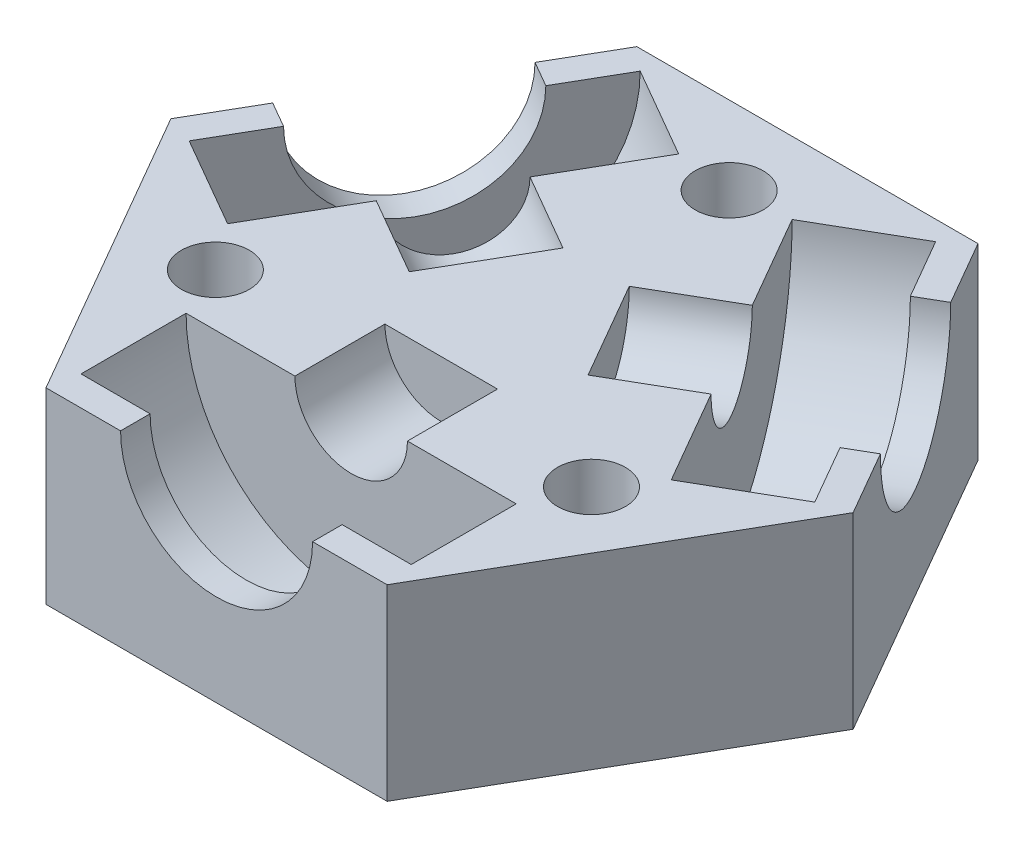
ISO-10303-21;
HEADER;
FILE_DESCRIPTION(('STEP AP214'),'2;1');
FILE_NAME('part.step','',(''),(''),'','','');
FILE_SCHEMA(('AUTOMOTIVE_DESIGN { 1 0 10303 214 1 1 1 1 }'));
ENDSEC;
DATA;
#1=APPLICATION_CONTEXT('core data for automotive mechanical design processes');
#2=APPLICATION_PROTOCOL_DEFINITION('international standard','automotive_design',2000,#1);
#3=PRODUCT_CONTEXT('',#1,'mechanical');
#4=PRODUCT('Part','Part','',(#3));
#5=PRODUCT_RELATED_PRODUCT_CATEGORY('part','',(#4));
#6=PRODUCT_DEFINITION_FORMATION('','',#4);
#7=PRODUCT_DEFINITION_CONTEXT('part definition',#1,'design');
#8=PRODUCT_DEFINITION('design','',#6,#7);
#9=PRODUCT_DEFINITION_SHAPE('','',#8);
#10=(LENGTH_UNIT() NAMED_UNIT(*) SI_UNIT(.MILLI.,.METRE.));
#11=(NAMED_UNIT(*) PLANE_ANGLE_UNIT() SI_UNIT($,.RADIAN.));
#12=(NAMED_UNIT(*) SI_UNIT($,.STERADIAN.) SOLID_ANGLE_UNIT());
#13=UNCERTAINTY_MEASURE_WITH_UNIT(LENGTH_MEASURE(1.E-05),#10,'distance_accuracy_value','');
#14=(GEOMETRIC_REPRESENTATION_CONTEXT(3) GLOBAL_UNCERTAINTY_ASSIGNED_CONTEXT((#13)) GLOBAL_UNIT_ASSIGNED_CONTEXT((#10,
#11,#12)) REPRESENTATION_CONTEXT('',''));
#15=CARTESIAN_POINT('',(0.,0.,0.));
#16=DIRECTION('',(0.,0.,1.));
#17=DIRECTION('',(1.,0.,0.));
#18=AXIS2_PLACEMENT_3D('',#15,#16,#17);
#19=CARTESIAN_POINT('',(0.,12.7,0.));
#20=DIRECTION('',(0.,1.,0.));
#21=DIRECTION('',(0.,0.,1.));
#22=AXIS2_PLACEMENT_3D('',#19,#20,#21);
#23=PLANE('',#22);
#24=CARTESIAN_POINT('',(0.,12.7,-14.700006));
#25=DIRECTION('',(0.,1.,0.));
#26=DIRECTION('',(0.,0.,1.));
#27=AXIS2_PLACEMENT_3D('',#24,#25,#26);
#28=CIRCLE('',#27,2.3);
#29=CARTESIAN_POINT('',(0.,12.7,-12.400006));
#30=VERTEX_POINT('',#29);
#31=EDGE_CURVE('E822',#30,#30,#28,.T.);
#32=ORIENTED_EDGE('',*,*,#31,.F.);
#33=EDGE_LOOP('',(#32));
#34=FACE_BOUND('',#33,.T.);
#35=CARTESIAN_POINT('',(12.7305751676825,12.7,7.34999700000059));
#36=DIRECTION('',(0.,1.,0.));
#37=DIRECTION('',(0.,0.,1.));
#38=AXIS2_PLACEMENT_3D('',#35,#36,#37);
#39=CIRCLE('',#38,2.3);
#40=CARTESIAN_POINT('',(12.7305751676825,12.7,9.64999700000059));
#41=VERTEX_POINT('',#40);
#42=EDGE_CURVE('E826',#41,#41,#39,.T.);
#43=ORIENTED_EDGE('',*,*,#42,.F.);
#44=EDGE_LOOP('',(#43));
#45=FACE_BOUND('',#44,.T.);
#46=CARTESIAN_POINT('',(-12.7305751676823,12.7,7.3499970000007));
#47=DIRECTION('',(0.,1.,0.));
#48=DIRECTION('',(0.,0.,1.));
#49=AXIS2_PLACEMENT_3D('',#46,#47,#48);
#50=CIRCLE('',#49,2.3);
#51=CARTESIAN_POINT('',(-12.7305751676823,12.7,9.6499970000007));
#52=VERTEX_POINT('',#51);
#53=EDGE_CURVE('E836',#52,#52,#50,.T.);
#54=ORIENTED_EDGE('',*,*,#53,.F.);
#55=EDGE_LOOP('',(#54));
#56=FACE_BOUND('',#55,.T.);
#57=DIRECTION('',(-0.5,0.,0.866025403784439));
#58=VECTOR('',#57,1.);
#59=CARTESIAN_POINT('',(-11.5470053837925,12.7,-20.));
#60=LINE('',#59,#58);
#61=CARTESIAN_POINT('',(-11.5470053837925,12.7,-20.));
#62=VERTEX_POINT('',#61);
#63=CARTESIAN_POINT('',(-14.0705080756889,12.7,-15.6291651245987));
#64=VERTEX_POINT('',#63);
#65=EDGE_CURVE('E230',#62,#64,#60,.T.);
#66=ORIENTED_EDGE('',*,*,#65,.T.);
#67=DIRECTION('',(-0.866025403784443,0.,-0.499999999999992));
#68=VECTOR('',#67,1.);
#69=CARTESIAN_POINT('',(-14.0705080756889,12.7,-15.6291651245987));
#70=LINE('',#69,#68);
#71=CARTESIAN_POINT('',(-12.33845726812,12.7,-14.6291651245987));
#72=VERTEX_POINT('',#71);
#73=EDGE_CURVE('E61',#64,#72,#70,.F.);
#74=ORIENTED_EDGE('',*,*,#73,.T.);
#75=DIRECTION('',(0.499999999999992,0.,-0.866025403784443));
#76=VECTOR('',#75,1.);
#77=CARTESIAN_POINT('',(-15.58845726812,12.7,-8.99999999999986));
#78=LINE('',#77,#76);
#79=CARTESIAN_POINT('',(-10.0004572681201,12.7,-18.6786999126948));
#80=VERTEX_POINT('',#79);
#81=EDGE_CURVE('E11',#72,#80,#78,.T.);
#82=ORIENTED_EDGE('',*,*,#81,.T.);
#83=DIRECTION('',(-0.866025403784443,0.,-0.499999999999992));
#84=VECTOR('',#83,1.);
#85=CARTESIAN_POINT('',(-11.732508075689,12.7,-19.6786999126948));
#86=LINE('',#85,#84);
#87=CARTESIAN_POINT('',(-3.84128459640511,12.7,-15.1226999126949));
#88=VERTEX_POINT('',#87);
#89=EDGE_CURVE('E47',#80,#88,#86,.F.);
#90=ORIENTED_EDGE('',*,*,#89,.T.);
#91=DIRECTION('',(-0.499999999999992,0.,0.866025403784443));
#92=VECTOR('',#91,1.);
#93=CARTESIAN_POINT('',(-9.42928459640502,12.7,-5.44399999999991));
#94=LINE('',#93,#92);
#95=CARTESIAN_POINT('',(-7.52428459640505,12.7,-8.74355678841864));
#96=VERTEX_POINT('',#95);
#97=EDGE_CURVE('E376',#88,#96,#94,.T.);
#98=ORIENTED_EDGE('',*,*,#97,.T.);
#99=DIRECTION('',(-0.866025403784443,0.,-0.499999999999992));
#100=VECTOR('',#99,1.);
#101=CARTESIAN_POINT('',(-15.4155080756889,12.7,-13.2995567884186));
#102=LINE('',#101,#100);
#103=CARTESIAN_POINT('',(-2.24499373493509,12.7,-5.69555678841869));
#104=VERTEX_POINT('',#103);
#105=EDGE_CURVE('E383',#96,#104,#102,.F.);
#106=ORIENTED_EDGE('',*,*,#105,.T.);
#107=DIRECTION('',(-0.499999999999992,0.,0.866025403784443));
#108=VECTOR('',#107,1.);
#109=CARTESIAN_POINT('',(-4.14999373493505,12.7,-2.39599999999996));
#110=LINE('',#109,#108);
#111=CARTESIAN_POINT('',(-6.05499373493502,12.7,0.903556788418767));
#112=VERTEX_POINT('',#111);
#113=EDGE_CURVE('E380',#104,#112,#110,.T.);
#114=ORIENTED_EDGE('',*,*,#113,.T.);
#115=DIRECTION('',(-0.866025403784443,0.,-0.499999999999992));
#116=VECTOR('',#115,1.);
#117=CARTESIAN_POINT('',(-19.2255080756888,12.7,-6.70044321158111));
#118=LINE('',#117,#116);
#119=CARTESIAN_POINT('',(-11.334284596405,12.7,-2.14444321158119));
#120=VERTEX_POINT('',#119);
#121=EDGE_CURVE('E375',#112,#120,#118,.T.);
#122=ORIENTED_EDGE('',*,*,#121,.T.);
#123=CARTESIAN_POINT('',(-15.0172845964049,12.7,4.23469991269502));
#124=VERTEX_POINT('',#123);
#125=EDGE_CURVE('E371',#120,#124,#94,.T.);
#126=ORIENTED_EDGE('',*,*,#125,.T.);
#127=DIRECTION('',(-0.866025403784443,0.,-0.499999999999992));
#128=VECTOR('',#127,1.);
#129=CARTESIAN_POINT('',(-22.9085080756888,12.7,-0.321300087304903));
#130=LINE('',#129,#128);
#131=CARTESIAN_POINT('',(-21.1764572681199,12.7,0.678699912695081));
#132=VERTEX_POINT('',#131);
#133=EDGE_CURVE('E368',#124,#132,#130,.T.);
#134=ORIENTED_EDGE('',*,*,#133,.T.);
#135=CARTESIAN_POINT('',(-18.8384572681199,12.7,-3.37083487540097));
#136=VERTEX_POINT('',#135);
#137=EDGE_CURVE('E54',#132,#136,#78,.T.);
#138=ORIENTED_EDGE('',*,*,#137,.T.);
#139=DIRECTION('',(-0.866025403784443,0.,-0.499999999999992));
#140=VECTOR('',#139,1.);
#141=CARTESIAN_POINT('',(-20.5705080756888,12.7,-4.37083487540096));
#142=LINE('',#141,#140);
#143=CARTESIAN_POINT('',(-20.5705080756888,12.7,-4.37083487540096));
#144=VERTEX_POINT('',#143);
#145=EDGE_CURVE('E209',#136,#144,#142,.T.);
#146=ORIENTED_EDGE('',*,*,#145,.T.);
#147=CARTESIAN_POINT('',(-23.094010767585,12.7,0.));
#148=VERTEX_POINT('',#147);
#149=EDGE_CURVE('E219',#144,#148,#60,.T.);
#150=ORIENTED_EDGE('',*,*,#149,.T.);
#151=DIRECTION('',(0.5,0.,0.866025403784439));
#152=VECTOR('',#151,1.);
#153=CARTESIAN_POINT('',(-23.094010767585,12.7,0.));
#154=LINE('',#153,#152);
#155=CARTESIAN_POINT('',(-11.5470053837925,12.7,20.));
#156=VERTEX_POINT('',#155);
#157=EDGE_CURVE('E235',#148,#156,#154,.T.);
#158=ORIENTED_EDGE('',*,*,#157,.T.);
#159=DIRECTION('',(1.,0.,0.));
#160=VECTOR('',#159,1.);
#161=CARTESIAN_POINT('',(-11.5470053837925,12.7,20.));
#162=LINE('',#161,#160);
#163=CARTESIAN_POINT('',(-6.5,12.7,20.));
#164=VERTEX_POINT('',#163);
#165=EDGE_CURVE('E244',#156,#164,#162,.T.);
#166=ORIENTED_EDGE('',*,*,#165,.T.);
#167=DIRECTION('',(0.,0.,1.));
#168=VECTOR('',#167,1.);
#169=CARTESIAN_POINT('',(-6.5,12.7,20.));
#170=LINE('',#169,#168);
#171=CARTESIAN_POINT('',(-6.5,12.7,18.));
#172=VERTEX_POINT('',#171);
#173=EDGE_CURVE('E331',#164,#172,#170,.F.);
#174=ORIENTED_EDGE('',*,*,#173,.T.);
#175=DIRECTION('',(-1.,0.,0.));
#176=VECTOR('',#175,1.);
#177=CARTESIAN_POINT('',(0.,12.7,18.));
#178=LINE('',#177,#176);
#179=CARTESIAN_POINT('',(-11.176,12.7,18.));
#180=VERTEX_POINT('',#179);
#181=EDGE_CURVE('E306',#172,#180,#178,.T.);
#182=ORIENTED_EDGE('',*,*,#181,.T.);
#183=DIRECTION('',(0.,0.,1.));
#184=VECTOR('',#183,1.);
#185=CARTESIAN_POINT('',(-11.176,12.7,20.));
#186=LINE('',#185,#184);
#187=CARTESIAN_POINT('',(-11.176,12.7,10.888));
#188=VERTEX_POINT('',#187);
#189=EDGE_CURVE('E327',#180,#188,#186,.F.);
#190=ORIENTED_EDGE('',*,*,#189,.T.);
#191=DIRECTION('',(1.,0.,0.));
#192=VECTOR('',#191,1.);
#193=CARTESIAN_POINT('',(0.,12.7,10.888));
#194=LINE('',#193,#192);
#195=CARTESIAN_POINT('',(-3.81,12.7,10.888));
#196=VERTEX_POINT('',#195);
#197=EDGE_CURVE('E315',#188,#196,#194,.T.);
#198=ORIENTED_EDGE('',*,*,#197,.T.);
#199=DIRECTION('',(0.,0.,1.));
#200=VECTOR('',#199,1.);
#201=CARTESIAN_POINT('',(-3.81,12.7,20.));
#202=LINE('',#201,#200);
#203=CARTESIAN_POINT('',(-3.81,12.7,4.792));
#204=VERTEX_POINT('',#203);
#205=EDGE_CURVE('E323',#196,#204,#202,.F.);
#206=ORIENTED_EDGE('',*,*,#205,.T.);
#207=DIRECTION('',(1.,0.,0.));
#208=VECTOR('',#207,1.);
#209=CARTESIAN_POINT('',(0.,12.7,4.792));
#210=LINE('',#209,#208);
#211=CARTESIAN_POINT('',(3.81,12.7,4.792));
#212=VERTEX_POINT('',#211);
#213=EDGE_CURVE('E319',#204,#212,#210,.T.);
#214=ORIENTED_EDGE('',*,*,#213,.T.);
#215=DIRECTION('',(0.,0.,1.));
#216=VECTOR('',#215,1.);
#217=CARTESIAN_POINT('',(3.81,12.7,20.));
#218=LINE('',#217,#216);
#219=CARTESIAN_POINT('',(3.81,12.7,10.888));
#220=VERTEX_POINT('',#219);
#221=EDGE_CURVE('E314',#212,#220,#218,.T.);
#222=ORIENTED_EDGE('',*,*,#221,.T.);
#223=CARTESIAN_POINT('',(11.176,12.7,10.888));
#224=VERTEX_POINT('',#223);
#225=EDGE_CURVE('E310',#220,#224,#194,.T.);
#226=ORIENTED_EDGE('',*,*,#225,.T.);
#227=DIRECTION('',(0.,0.,1.));
#228=VECTOR('',#227,1.);
#229=CARTESIAN_POINT('',(11.176,12.7,20.));
#230=LINE('',#229,#228);
#231=CARTESIAN_POINT('',(11.176,12.7,18.));
#232=VERTEX_POINT('',#231);
#233=EDGE_CURVE('E305',#224,#232,#230,.T.);
#234=ORIENTED_EDGE('',*,*,#233,.T.);
#235=CARTESIAN_POINT('',(6.5,12.7,18.));
#236=VERTEX_POINT('',#235);
#237=EDGE_CURVE('E301',#232,#236,#178,.T.);
#238=ORIENTED_EDGE('',*,*,#237,.T.);
#239=DIRECTION('',(0.,0.,1.));
#240=VECTOR('',#239,1.);
#241=CARTESIAN_POINT('',(6.5,12.7,20.));
#242=LINE('',#241,#240);
#243=CARTESIAN_POINT('',(6.5,12.7,20.));
#244=VERTEX_POINT('',#243);
#245=EDGE_CURVE('E297',#236,#244,#242,.T.);
#246=ORIENTED_EDGE('',*,*,#245,.T.);
#247=CARTESIAN_POINT('',(11.5470053837925,12.7,20.));
#248=VERTEX_POINT('',#247);
#249=EDGE_CURVE('E243',#244,#248,#162,.T.);
#250=ORIENTED_EDGE('',*,*,#249,.T.);
#251=DIRECTION('',(0.5,0.,-0.866025403784439));
#252=VECTOR('',#251,1.);
#253=CARTESIAN_POINT('',(11.5470053837925,12.7,20.));
#254=LINE('',#253,#252);
#255=CARTESIAN_POINT('',(23.094010767585,12.7,0.));
#256=VERTEX_POINT('',#255);
#257=EDGE_CURVE('E248',#248,#256,#254,.T.);
#258=ORIENTED_EDGE('',*,*,#257,.T.);
#259=DIRECTION('',(-0.5,0.,-0.866025403784438));
#260=VECTOR('',#259,1.);
#261=CARTESIAN_POINT('',(23.094010767585,12.7,0.));
#262=LINE('',#261,#260);
#263=CARTESIAN_POINT('',(20.5705080756887,12.7,-4.37083487540123));
#264=VERTEX_POINT('',#263);
#265=EDGE_CURVE('E252',#256,#264,#262,.T.);
#266=ORIENTED_EDGE('',*,*,#265,.T.);
#267=DIRECTION('',(0.866025403784436,0.,-0.500000000000004));
#268=VECTOR('',#267,1.);
#269=CARTESIAN_POINT('',(20.5705080756888,12.7,-4.37083487540125));
#270=LINE('',#269,#268);
#271=CARTESIAN_POINT('',(18.8384572681199,12.7,-3.37083487540124));
#272=VERTEX_POINT('',#271);
#273=EDGE_CURVE('E69',#264,#272,#270,.F.);
#274=ORIENTED_EDGE('',*,*,#273,.T.);
#275=DIRECTION('',(0.500000000000004,0.,0.866025403784436));
#276=VECTOR('',#275,1.);
#277=CARTESIAN_POINT('',(15.5884572681199,12.7,-9.00000000000007));
#278=LINE('',#277,#276);
#279=CARTESIAN_POINT('',(21.1764572681199,12.7,0.678699912694782));
#280=VERTEX_POINT('',#279);
#281=EDGE_CURVE('E215',#272,#280,#278,.T.);
#282=ORIENTED_EDGE('',*,*,#281,.T.);
#283=DIRECTION('',(0.866025403784436,0.,-0.500000000000004));
#284=VECTOR('',#283,1.);
#285=CARTESIAN_POINT('',(22.9085080756888,12.7,-0.32130008730522));
#286=LINE('',#285,#284);
#287=CARTESIAN_POINT('',(15.017284596405,12.7,4.23469991269482));
#288=VERTEX_POINT('',#287);
#289=EDGE_CURVE('E363',#280,#288,#286,.F.);
#290=ORIENTED_EDGE('',*,*,#289,.T.);
#291=DIRECTION('',(-0.500000000000004,0.,-0.866025403784436));
#292=VECTOR('',#291,1.);
#293=CARTESIAN_POINT('',(9.42928459640495,12.7,-5.44400000000005));
#294=LINE('',#293,#292);
#295=CARTESIAN_POINT('',(11.334284596405,12.7,-2.14444321158135));
#296=VERTEX_POINT('',#295);
#297=EDGE_CURVE('E351',#288,#296,#294,.T.);
#298=ORIENTED_EDGE('',*,*,#297,.T.);
#299=DIRECTION('',(0.866025403784436,0.,-0.500000000000004));
#300=VECTOR('',#299,1.);
#301=CARTESIAN_POINT('',(19.2255080756887,12.7,-6.70044321158138));
#302=LINE('',#301,#300);
#303=CARTESIAN_POINT('',(6.05499373493504,12.7,0.903556788418682));
#304=VERTEX_POINT('',#303);
#305=EDGE_CURVE('E359',#296,#304,#302,.F.);
#306=ORIENTED_EDGE('',*,*,#305,.T.);
#307=DIRECTION('',(-0.500000000000004,0.,-0.866025403784436));
#308=VECTOR('',#307,1.);
#309=CARTESIAN_POINT('',(4.14999373493502,12.7,-2.39600000000002));
#310=LINE('',#309,#308);
#311=CARTESIAN_POINT('',(2.24499373493501,12.7,-5.69555678841872));
#312=VERTEX_POINT('',#311);
#313=EDGE_CURVE('E355',#304,#312,#310,.T.);
#314=ORIENTED_EDGE('',*,*,#313,.T.);
#315=DIRECTION('',(0.866025403784436,0.,-0.500000000000004));
#316=VECTOR('',#315,1.);
#317=CARTESIAN_POINT('',(15.4155080756887,12.7,-13.2995567884188));
#318=LINE('',#317,#316);
#319=CARTESIAN_POINT('',(7.52428459640493,12.7,-8.74355678841875));
#320=VERTEX_POINT('',#319);
#321=EDGE_CURVE('E350',#312,#320,#318,.T.);
#322=ORIENTED_EDGE('',*,*,#321,.T.);
#323=CARTESIAN_POINT('',(3.8412845964049,12.7,-15.1226999126949));
#324=VERTEX_POINT('',#323);
#325=EDGE_CURVE('E346',#320,#324,#294,.T.);
#326=ORIENTED_EDGE('',*,*,#325,.T.);
#327=DIRECTION('',(0.866025403784436,0.,-0.500000000000004));
#328=VECTOR('',#327,1.);
#329=CARTESIAN_POINT('',(11.7325080756887,12.7,-19.6786999126949));
#330=LINE('',#329,#328);
#331=CARTESIAN_POINT('',(10.0004572681198,12.7,-18.6786999126949));
#332=VERTEX_POINT('',#331);
#333=EDGE_CURVE('E342',#324,#332,#330,.T.);
#334=ORIENTED_EDGE('',*,*,#333,.T.);
#335=CARTESIAN_POINT('',(12.3384572681198,12.7,-14.6291651245989));
#336=VERTEX_POINT('',#335);
#337=EDGE_CURVE('E338',#332,#336,#278,.T.);
#338=ORIENTED_EDGE('',*,*,#337,.T.);
#339=DIRECTION('',(0.866025403784436,0.,-0.500000000000004));
#340=VECTOR('',#339,1.);
#341=CARTESIAN_POINT('',(14.0705080756887,12.7,-15.6291651245989));
#342=LINE('',#341,#340);
#343=CARTESIAN_POINT('',(14.0705080756887,12.7,-15.6291651245989));
#344=VERTEX_POINT('',#343);
#345=EDGE_CURVE('E439',#336,#344,#342,.T.);
#346=ORIENTED_EDGE('',*,*,#345,.T.);
#347=CARTESIAN_POINT('',(11.5470053837925,12.7,-20.));
#348=VERTEX_POINT('',#347);
#349=EDGE_CURVE('E251',#344,#348,#262,.T.);
#350=ORIENTED_EDGE('',*,*,#349,.T.);
#351=DIRECTION('',(-1.,0.,0.));
#352=VECTOR('',#351,1.);
#353=CARTESIAN_POINT('',(11.5470053837925,12.7,-20.));
#354=LINE('',#353,#352);
#355=EDGE_CURVE('E231',#348,#62,#354,.T.);
#356=ORIENTED_EDGE('',*,*,#355,.T.);
#357=EDGE_LOOP('',(#66,#74,#82,#90,#98,#106,#114,#122,#126,#134,#138,#146,#150,#158,#166,#174,
#182,#190,#198,#206,#214,#222,#226,#234,#238,#246,#250,#258,#266,#274,#282,#290,#298,#306,#314,
#322,#326,#334,#338,#346,#350,#356));
#358=FACE_BOUND('',#357,.T.);
#359=ADVANCED_FACE('F43',(#34,#45,#56,#358),#23,.T.);
#360=CARTESIAN_POINT('',(11.5470053837925,12.7,-20.));
#361=DIRECTION('',(0.,0.,1.));
#362=DIRECTION('',(1.,0.,0.));
#363=AXIS2_PLACEMENT_3D('',#360,#361,#362);
#364=PLANE('',#363);
#365=DIRECTION('',(-1.,0.,0.));
#366=VECTOR('',#365,1.);
#367=CARTESIAN_POINT('',(11.5470053837925,0.,-20.));
#368=LINE('',#367,#366);
#369=CARTESIAN_POINT('',(11.5470053837925,0.,-20.));
#370=VERTEX_POINT('',#369);
#371=CARTESIAN_POINT('',(-11.5470053837925,0.,-20.));
#372=VERTEX_POINT('',#371);
#373=EDGE_CURVE('E257',#370,#372,#368,.T.);
#374=ORIENTED_EDGE('',*,*,#373,.T.);
#375=DIRECTION('',(0.,-1.,0.));
#376=VECTOR('',#375,1.);
#377=CARTESIAN_POINT('',(-11.5470053837925,12.7,-20.));
#378=LINE('',#377,#376);
#379=EDGE_CURVE('E293',#62,#372,#378,.T.);
#380=ORIENTED_EDGE('',*,*,#379,.F.);
#381=ORIENTED_EDGE('',*,*,#355,.F.);
#382=DIRECTION('',(0.,-1.,0.));
#383=VECTOR('',#382,1.);
#384=CARTESIAN_POINT('',(11.5470053837925,12.7,-20.));
#385=LINE('',#384,#383);
#386=EDGE_CURVE('E256',#348,#370,#385,.T.);
#387=ORIENTED_EDGE('',*,*,#386,.T.);
#388=EDGE_LOOP('',(#374,#380,#381,#387));
#389=FACE_BOUND('',#388,.T.);
#390=ADVANCED_FACE('F45',(#389),#364,.F.);
#391=CARTESIAN_POINT('',(-11.5470053837925,12.7,-20.));
#392=DIRECTION('',(0.866025403784438,0.,0.5));
#393=DIRECTION('',(0.5,0.,-0.866025403784439));
#394=AXIS2_PLACEMENT_3D('',#391,#392,#393);
#395=PLANE('',#394);
#396=CARTESIAN_POINT('',(-17.3205080756889,12.7,-9.99999999999984));
#397=DIRECTION('',(0.866025403784438,0.,0.5));
#398=DIRECTION('',(0.5,0.,-0.866025403784439));
#399=AXIS2_PLACEMENT_3D('',#396,#397,#398);
#400=CIRCLE('',#399,6.5);
#401=EDGE_CURVE('E206',#64,#144,#400,.F.);
#402=ORIENTED_EDGE('',*,*,#401,.F.);
#403=ORIENTED_EDGE('',*,*,#65,.F.);
#404=ORIENTED_EDGE('',*,*,#379,.T.);
#405=DIRECTION('',(-0.5,0.,0.866025403784439));
#406=VECTOR('',#405,1.);
#407=CARTESIAN_POINT('',(-11.5470053837925,0.,-20.));
#408=LINE('',#407,#406);
#409=CARTESIAN_POINT('',(-23.094010767585,0.,0.));
#410=VERTEX_POINT('',#409);
#411=EDGE_CURVE('E261',#372,#410,#408,.T.);
#412=ORIENTED_EDGE('',*,*,#411,.T.);
#413=DIRECTION('',(0.,-1.,0.));
#414=VECTOR('',#413,1.);
#415=CARTESIAN_POINT('',(-23.094010767585,12.7,0.));
#416=LINE('',#415,#414);
#417=EDGE_CURVE('E227',#148,#410,#416,.T.);
#418=ORIENTED_EDGE('',*,*,#417,.F.);
#419=ORIENTED_EDGE('',*,*,#149,.F.);
#420=EDGE_LOOP('',(#402,#403,#404,#412,#418,#419));
#421=FACE_BOUND('',#420,.T.);
#422=ADVANCED_FACE('F225',(#421),#395,.F.);
#423=CARTESIAN_POINT('',(-23.094010767585,12.7,0.));
#424=DIRECTION('',(0.866025403784439,0.,-0.5));
#425=DIRECTION('',(-0.5,0.,-0.866025403784439));
#426=AXIS2_PLACEMENT_3D('',#423,#424,#425);
#427=PLANE('',#426);
#428=DIRECTION('',(0.5,0.,0.866025403784439));
#429=VECTOR('',#428,1.);
#430=CARTESIAN_POINT('',(-23.094010767585,0.,0.));
#431=LINE('',#430,#429);
#432=CARTESIAN_POINT('',(-11.5470053837925,0.,20.));
#433=VERTEX_POINT('',#432);
#434=EDGE_CURVE('E265',#410,#433,#431,.T.);
#435=ORIENTED_EDGE('',*,*,#434,.T.);
#436=DIRECTION('',(0.,-1.,0.));
#437=VECTOR('',#436,1.);
#438=CARTESIAN_POINT('',(-11.5470053837925,12.7,20.));
#439=LINE('',#438,#437);
#440=EDGE_CURVE('E287',#156,#433,#439,.T.);
#441=ORIENTED_EDGE('',*,*,#440,.F.);
#442=ORIENTED_EDGE('',*,*,#157,.F.);
#443=ORIENTED_EDGE('',*,*,#417,.T.);
#444=EDGE_LOOP('',(#435,#441,#442,#443));
#445=FACE_BOUND('',#444,.T.);
#446=ADVANCED_FACE('F551',(#445),#427,.F.);
#447=CARTESIAN_POINT('',(-11.5470053837925,12.7,20.));
#448=DIRECTION('',(0.,0.,-1.));
#449=DIRECTION('',(-1.,0.,0.));
#450=AXIS2_PLACEMENT_3D('',#447,#448,#449);
#451=PLANE('',#450);
#452=CARTESIAN_POINT('',(0.,12.7,20.));
#453=DIRECTION('',(0.,0.,1.));
#454=DIRECTION('',(1.,0.,0.));
#455=AXIS2_PLACEMENT_3D('',#452,#453,#454);
#456=CIRCLE('',#455,6.5);
#457=EDGE_CURVE('E445',#164,#244,#456,.T.);
#458=ORIENTED_EDGE('',*,*,#457,.F.);
#459=ORIENTED_EDGE('',*,*,#165,.F.);
#460=ORIENTED_EDGE('',*,*,#440,.T.);
#461=DIRECTION('',(1.,0.,0.));
#462=VECTOR('',#461,1.);
#463=CARTESIAN_POINT('',(-11.5470053837925,0.,20.));
#464=LINE('',#463,#462);
#465=CARTESIAN_POINT('',(11.5470053837925,0.,20.));
#466=VERTEX_POINT('',#465);
#467=EDGE_CURVE('E268',#433,#466,#464,.T.);
#468=ORIENTED_EDGE('',*,*,#467,.T.);
#469=DIRECTION('',(0.,-1.,0.));
#470=VECTOR('',#469,1.);
#471=CARTESIAN_POINT('',(11.5470053837925,12.7,20.));
#472=LINE('',#471,#470);
#473=EDGE_CURVE('E283',#248,#466,#472,.T.);
#474=ORIENTED_EDGE('',*,*,#473,.F.);
#475=ORIENTED_EDGE('',*,*,#249,.F.);
#476=EDGE_LOOP('',(#458,#459,#460,#468,#474,#475));
#477=FACE_BOUND('',#476,.T.);
#478=ADVANCED_FACE('F492',(#477),#451,.F.);
#479=CARTESIAN_POINT('',(11.5470053837925,12.7,20.));
#480=DIRECTION('',(-0.866025403784439,0.,-0.5));
#481=DIRECTION('',(-0.5,0.,0.866025403784439));
#482=AXIS2_PLACEMENT_3D('',#479,#480,#481);
#483=PLANE('',#482);
#484=DIRECTION('',(0.5,0.,-0.866025403784439));
#485=VECTOR('',#484,1.);
#486=CARTESIAN_POINT('',(11.5470053837925,0.,20.));
#487=LINE('',#486,#485);
#488=CARTESIAN_POINT('',(23.094010767585,0.,0.));
#489=VERTEX_POINT('',#488);
#490=EDGE_CURVE('E271',#466,#489,#487,.T.);
#491=ORIENTED_EDGE('',*,*,#490,.T.);
#492=DIRECTION('',(0.,-1.,0.));
#493=VECTOR('',#492,1.);
#494=CARTESIAN_POINT('',(23.094010767585,12.7,0.));
#495=LINE('',#494,#493);
#496=EDGE_CURVE('E279',#256,#489,#495,.T.);
#497=ORIENTED_EDGE('',*,*,#496,.F.);
#498=ORIENTED_EDGE('',*,*,#257,.F.);
#499=ORIENTED_EDGE('',*,*,#473,.T.);
#500=EDGE_LOOP('',(#491,#497,#498,#499));
#501=FACE_BOUND('',#500,.T.);
#502=ADVANCED_FACE('F496',(#501),#483,.F.);
#503=CARTESIAN_POINT('',(23.094010767585,12.7,0.));
#504=DIRECTION('',(-0.866025403784439,0.,0.5));
#505=DIRECTION('',(0.5,0.,0.866025403784439));
#506=AXIS2_PLACEMENT_3D('',#503,#504,#505);
#507=PLANE('',#506);
#508=CARTESIAN_POINT('',(17.3205080756887,12.7,-10.0000000000001));
#509=DIRECTION('',(-0.866025403784439,0.,0.5));
#510=DIRECTION('',(0.5,0.,0.866025403784439));
#511=AXIS2_PLACEMENT_3D('',#508,#509,#510);
#512=CIRCLE('',#511,6.5);
#513=EDGE_CURVE('E335',#264,#344,#512,.F.);
#514=ORIENTED_EDGE('',*,*,#513,.F.);
#515=ORIENTED_EDGE('',*,*,#265,.F.);
#516=ORIENTED_EDGE('',*,*,#496,.T.);
#517=DIRECTION('',(-0.5,0.,-0.866025403784438));
#518=VECTOR('',#517,1.);
#519=CARTESIAN_POINT('',(23.094010767585,0.,0.));
#520=LINE('',#519,#518);
#521=EDGE_CURVE('E237',#489,#370,#520,.T.);
#522=ORIENTED_EDGE('',*,*,#521,.T.);
#523=ORIENTED_EDGE('',*,*,#386,.F.);
#524=ORIENTED_EDGE('',*,*,#349,.F.);
#525=EDGE_LOOP('',(#514,#515,#516,#522,#523,#524));
#526=FACE_BOUND('',#525,.T.);
#527=ADVANCED_FACE('F500',(#526),#507,.F.);
#528=CARTESIAN_POINT('',(0.,0.,0.));
#529=DIRECTION('',(0.,1.,0.));
#530=DIRECTION('',(0.,0.,1.));
#531=AXIS2_PLACEMENT_3D('',#528,#529,#530);
#532=PLANE('',#531);
#533=ORIENTED_EDGE('',*,*,#373,.F.);
#534=ORIENTED_EDGE('',*,*,#521,.F.);
#535=ORIENTED_EDGE('',*,*,#490,.F.);
#536=ORIENTED_EDGE('',*,*,#467,.F.);
#537=ORIENTED_EDGE('',*,*,#434,.F.);
#538=ORIENTED_EDGE('',*,*,#411,.F.);
#539=EDGE_LOOP('',(#533,#534,#535,#536,#537,#538));
#540=FACE_BOUND('',#539,.T.);
#541=ADVANCED_FACE('F541',(#540),#532,.F.);
#542=CARTESIAN_POINT('',(0.,12.7,4.792));
#543=DIRECTION('',(0.,0.,1.));
#544=DIRECTION('',(1.,0.,0.));
#545=AXIS2_PLACEMENT_3D('',#542,#543,#544);
#546=PLANE('',#545);
#547=CARTESIAN_POINT('',(0.,12.7,4.792));
#548=DIRECTION('',(0.,0.,1.));
#549=DIRECTION('',(1.,0.,0.));
#550=AXIS2_PLACEMENT_3D('',#547,#548,#549);
#551=CIRCLE('',#550,3.81);
#552=EDGE_CURVE('E262',#204,#212,#551,.T.);
#553=ORIENTED_EDGE('',*,*,#552,.T.);
#554=ORIENTED_EDGE('',*,*,#213,.F.);
#555=EDGE_LOOP('',(#553,#554));
#556=FACE_BOUND('',#555,.T.);
#557=ADVANCED_FACE('F467',(#556),#546,.T.);
#558=CARTESIAN_POINT('',(0.,12.7,20.));
#559=DIRECTION('',(0.,0.,1.));
#560=DIRECTION('',(1.,0.,0.));
#561=AXIS2_PLACEMENT_3D('',#558,#559,#560);
#562=CYLINDRICAL_SURFACE('',#561,3.81);
#563=CARTESIAN_POINT('',(0.,12.7,10.888));
#564=DIRECTION('',(0.,0.,1.));
#565=DIRECTION('',(1.,0.,0.));
#566=AXIS2_PLACEMENT_3D('',#563,#564,#565);
#567=CIRCLE('',#566,3.81);
#568=EDGE_CURVE('E460',#196,#220,#567,.T.);
#569=ORIENTED_EDGE('',*,*,#568,.T.);
#570=ORIENTED_EDGE('',*,*,#221,.F.);
#571=ORIENTED_EDGE('',*,*,#552,.F.);
#572=ORIENTED_EDGE('',*,*,#205,.F.);
#573=EDGE_LOOP('',(#569,#570,#571,#572));
#574=FACE_BOUND('',#573,.T.);
#575=ADVANCED_FACE('F471',(#574),#562,.F.);
#576=CARTESIAN_POINT('',(-3.81,12.7,10.888));
#577=DIRECTION('',(0.,0.,1.));
#578=DIRECTION('',(1.,0.,0.));
#579=AXIS2_PLACEMENT_3D('',#576,#577,#578);
#580=PLANE('',#579);
#581=CARTESIAN_POINT('',(0.,12.7,10.888));
#582=DIRECTION('',(0.,0.,1.));
#583=DIRECTION('',(1.,0.,0.));
#584=AXIS2_PLACEMENT_3D('',#581,#582,#583);
#585=CIRCLE('',#584,11.176);
#586=EDGE_CURVE('E456',#188,#224,#585,.T.);
#587=ORIENTED_EDGE('',*,*,#586,.T.);
#588=ORIENTED_EDGE('',*,*,#225,.F.);
#589=ORIENTED_EDGE('',*,*,#568,.F.);
#590=ORIENTED_EDGE('',*,*,#197,.F.);
#591=EDGE_LOOP('',(#587,#588,#589,#590));
#592=FACE_BOUND('',#591,.T.);
#593=ADVANCED_FACE('F473',(#592),#580,.T.);
#594=CARTESIAN_POINT('',(0.,12.7,20.));
#595=DIRECTION('',(0.,0.,1.));
#596=DIRECTION('',(1.,0.,0.));
#597=AXIS2_PLACEMENT_3D('',#594,#595,#596);
#598=CYLINDRICAL_SURFACE('',#597,11.176);
#599=CARTESIAN_POINT('',(0.,12.7,18.));
#600=DIRECTION('',(0.,0.,1.));
#601=DIRECTION('',(1.,0.,0.));
#602=AXIS2_PLACEMENT_3D('',#599,#600,#601);
#603=CIRCLE('',#602,11.176);
#604=EDGE_CURVE('E452',#180,#232,#603,.T.);
#605=ORIENTED_EDGE('',*,*,#604,.T.);
#606=ORIENTED_EDGE('',*,*,#233,.F.);
#607=ORIENTED_EDGE('',*,*,#586,.F.);
#608=ORIENTED_EDGE('',*,*,#189,.F.);
#609=EDGE_LOOP('',(#605,#606,#607,#608));
#610=FACE_BOUND('',#609,.T.);
#611=ADVANCED_FACE('F476',(#610),#598,.F.);
#612=CARTESIAN_POINT('',(-11.176,12.7,18.));
#613=DIRECTION('',(0.,0.,-1.));
#614=DIRECTION('',(-1.,0.,0.));
#615=AXIS2_PLACEMENT_3D('',#612,#613,#614);
#616=PLANE('',#615);
#617=ORIENTED_EDGE('',*,*,#604,.F.);
#618=ORIENTED_EDGE('',*,*,#181,.F.);
#619=CARTESIAN_POINT('',(0.,12.7,18.));
#620=DIRECTION('',(0.,0.,1.));
#621=DIRECTION('',(1.,0.,0.));
#622=AXIS2_PLACEMENT_3D('',#619,#620,#621);
#623=CIRCLE('',#622,6.5);
#624=EDGE_CURVE('E448',#172,#236,#623,.T.);
#625=ORIENTED_EDGE('',*,*,#624,.T.);
#626=ORIENTED_EDGE('',*,*,#237,.F.);
#627=EDGE_LOOP('',(#617,#618,#625,#626));
#628=FACE_BOUND('',#627,.T.);
#629=ADVANCED_FACE('F480',(#628),#616,.T.);
#630=CARTESIAN_POINT('',(0.,12.7,20.));
#631=DIRECTION('',(0.,0.,1.));
#632=DIRECTION('',(1.,0.,0.));
#633=AXIS2_PLACEMENT_3D('',#630,#631,#632);
#634=CYLINDRICAL_SURFACE('',#633,6.5);
#635=ORIENTED_EDGE('',*,*,#457,.T.);
#636=ORIENTED_EDGE('',*,*,#245,.F.);
#637=ORIENTED_EDGE('',*,*,#624,.F.);
#638=ORIENTED_EDGE('',*,*,#173,.F.);
#639=EDGE_LOOP('',(#635,#636,#637,#638));
#640=FACE_BOUND('',#639,.T.);
#641=ADVANCED_FACE('F520',(#640),#634,.F.);
#642=CARTESIAN_POINT('',(4.14999373493502,12.7,-2.39600000000002));
#643=DIRECTION('',(0.866025403784436,0.,-0.500000000000004));
#644=DIRECTION('',(-0.500000000000004,0.,-0.866025403784436));
#645=AXIS2_PLACEMENT_3D('',#642,#643,#644);
#646=PLANE('',#645);
#647=CARTESIAN_POINT('',(4.14999373493502,12.7,-2.39600000000002));
#648=DIRECTION('',(0.866025403784436,0.,-0.500000000000004));
#649=DIRECTION('',(-0.500000000000004,0.,-0.866025403784436));
#650=AXIS2_PLACEMENT_3D('',#647,#648,#649);
#651=CIRCLE('',#650,3.81);
#652=EDGE_CURVE('E435',#304,#312,#651,.T.);
#653=ORIENTED_EDGE('',*,*,#652,.T.);
#654=ORIENTED_EDGE('',*,*,#313,.F.);
#655=EDGE_LOOP('',(#653,#654));
#656=FACE_BOUND('',#655,.T.);
#657=ADVANCED_FACE('F518',(#656),#646,.T.);
#658=CARTESIAN_POINT('',(17.3205080756887,12.7,-10.0000000000001));
#659=DIRECTION('',(0.866025403784436,0.,-0.500000000000004));
#660=DIRECTION('',(-0.500000000000004,0.,-0.866025403784436));
#661=AXIS2_PLACEMENT_3D('',#658,#659,#660);
#662=CYLINDRICAL_SURFACE('',#661,3.81);
#663=CARTESIAN_POINT('',(9.42928459640495,12.7,-5.44400000000005));
#664=DIRECTION('',(0.866025403784436,0.,-0.500000000000004));
#665=DIRECTION('',(-0.500000000000004,0.,-0.866025403784436));
#666=AXIS2_PLACEMENT_3D('',#663,#664,#665);
#667=CIRCLE('',#666,3.81);
#668=EDGE_CURVE('E431',#296,#320,#667,.T.);
#669=ORIENTED_EDGE('',*,*,#668,.T.);
#670=ORIENTED_EDGE('',*,*,#321,.F.);
#671=ORIENTED_EDGE('',*,*,#652,.F.);
#672=ORIENTED_EDGE('',*,*,#305,.F.);
#673=EDGE_LOOP('',(#669,#670,#671,#672));
#674=FACE_BOUND('',#673,.T.);
#675=ADVANCED_FACE('F515',(#674),#662,.F.);
#676=CARTESIAN_POINT('',(11.334284596405,12.7,-2.14444321158134));
#677=DIRECTION('',(0.866025403784436,0.,-0.500000000000004));
#678=DIRECTION('',(-0.500000000000004,0.,-0.866025403784436));
#679=AXIS2_PLACEMENT_3D('',#676,#677,#678);
#680=PLANE('',#679);
#681=CARTESIAN_POINT('',(9.42928459640495,12.7,-5.44400000000005));
#682=DIRECTION('',(0.866025403784436,0.,-0.500000000000004));
#683=DIRECTION('',(-0.500000000000004,0.,-0.866025403784436));
#684=AXIS2_PLACEMENT_3D('',#681,#682,#683);
#685=CIRCLE('',#684,11.176);
#686=EDGE_CURVE('E427',#288,#324,#685,.T.);
#687=ORIENTED_EDGE('',*,*,#686,.T.);
#688=ORIENTED_EDGE('',*,*,#325,.F.);
#689=ORIENTED_EDGE('',*,*,#668,.F.);
#690=ORIENTED_EDGE('',*,*,#297,.F.);
#691=EDGE_LOOP('',(#687,#688,#689,#690));
#692=FACE_BOUND('',#691,.T.);
#693=ADVANCED_FACE('F511',(#692),#680,.T.);
#694=CARTESIAN_POINT('',(17.3205080756887,12.7,-10.0000000000001));
#695=DIRECTION('',(0.866025403784436,0.,-0.500000000000004));
#696=DIRECTION('',(-0.500000000000004,0.,-0.866025403784436));
#697=AXIS2_PLACEMENT_3D('',#694,#695,#696);
#698=CYLINDRICAL_SURFACE('',#697,11.176);
#699=CARTESIAN_POINT('',(15.5884572681199,12.7,-9.00000000000008));
#700=DIRECTION('',(0.866025403784436,0.,-0.500000000000004));
#701=DIRECTION('',(-0.500000000000004,0.,-0.866025403784436));
#702=AXIS2_PLACEMENT_3D('',#699,#700,#701);
#703=CIRCLE('',#702,11.176);
#704=EDGE_CURVE('E423',#280,#332,#703,.T.);
#705=ORIENTED_EDGE('',*,*,#704,.T.);
#706=ORIENTED_EDGE('',*,*,#333,.F.);
#707=ORIENTED_EDGE('',*,*,#686,.F.);
#708=ORIENTED_EDGE('',*,*,#289,.F.);
#709=EDGE_LOOP('',(#705,#706,#707,#708));
#710=FACE_BOUND('',#709,.T.);
#711=ADVANCED_FACE('F513',(#710),#698,.F.);
#712=CARTESIAN_POINT('',(21.1764572681199,12.7,0.678699912694786));
#713=DIRECTION('',(-0.866025403784436,0.,0.500000000000004));
#714=DIRECTION('',(0.500000000000004,0.,0.866025403784436));
#715=AXIS2_PLACEMENT_3D('',#712,#713,#714);
#716=PLANE('',#715);
#717=ORIENTED_EDGE('',*,*,#704,.F.);
#718=ORIENTED_EDGE('',*,*,#281,.F.);
#719=CARTESIAN_POINT('',(15.5884572681199,12.7,-9.00000000000008));
#720=DIRECTION('',(0.866025403784436,0.,-0.500000000000004));
#721=DIRECTION('',(-0.500000000000004,0.,-0.866025403784436));
#722=AXIS2_PLACEMENT_3D('',#719,#720,#721);
#723=CIRCLE('',#722,6.5);
#724=EDGE_CURVE('E419',#272,#336,#723,.T.);
#725=ORIENTED_EDGE('',*,*,#724,.T.);
#726=ORIENTED_EDGE('',*,*,#337,.F.);
#727=EDGE_LOOP('',(#717,#718,#725,#726));
#728=FACE_BOUND('',#727,.T.);
#729=ADVANCED_FACE('F654',(#728),#716,.T.);
#730=CARTESIAN_POINT('',(17.3205080756887,12.7,-10.0000000000001));
#731=DIRECTION('',(0.866025403784436,0.,-0.500000000000004));
#732=DIRECTION('',(-0.500000000000004,0.,-0.866025403784436));
#733=AXIS2_PLACEMENT_3D('',#730,#731,#732);
#734=CYLINDRICAL_SURFACE('',#733,6.5);
#735=ORIENTED_EDGE('',*,*,#513,.T.);
#736=ORIENTED_EDGE('',*,*,#345,.F.);
#737=ORIENTED_EDGE('',*,*,#724,.F.);
#738=ORIENTED_EDGE('',*,*,#273,.F.);
#739=EDGE_LOOP('',(#735,#736,#737,#738));
#740=FACE_BOUND('',#739,.T.);
#741=ADVANCED_FACE('F664',(#740),#734,.F.);
#742=CARTESIAN_POINT('',(-4.14999373493505,12.7,-2.39599999999996));
#743=DIRECTION('',(-0.866025403784443,0.,-0.499999999999992));
#744=DIRECTION('',(-0.499999999999992,0.,0.866025403784443));
#745=AXIS2_PLACEMENT_3D('',#742,#743,#744);
#746=PLANE('',#745);
#747=CARTESIAN_POINT('',(-4.14999373493505,12.7,-2.39599999999996));
#748=DIRECTION('',(-0.866025403784443,0.,-0.499999999999992));
#749=DIRECTION('',(-0.499999999999992,0.,0.866025403784443));
#750=AXIS2_PLACEMENT_3D('',#747,#748,#749);
#751=CIRCLE('',#750,3.81);
#752=EDGE_CURVE('E223',#104,#112,#751,.T.);
#753=ORIENTED_EDGE('',*,*,#752,.T.);
#754=ORIENTED_EDGE('',*,*,#113,.F.);
#755=EDGE_LOOP('',(#753,#754));
#756=FACE_BOUND('',#755,.T.);
#757=ADVANCED_FACE('F674',(#756),#746,.T.);
#758=CARTESIAN_POINT('',(-17.3205080756889,12.7,-9.99999999999984));
#759=DIRECTION('',(-0.866025403784443,0.,-0.499999999999992));
#760=DIRECTION('',(-0.499999999999992,0.,0.866025403784443));
#761=AXIS2_PLACEMENT_3D('',#758,#759,#760);
#762=CYLINDRICAL_SURFACE('',#761,3.81);
#763=CARTESIAN_POINT('',(-9.42928459640502,12.7,-5.44399999999991));
#764=DIRECTION('',(-0.866025403784443,0.,-0.499999999999992));
#765=DIRECTION('',(-0.499999999999992,0.,0.866025403784443));
#766=AXIS2_PLACEMENT_3D('',#763,#764,#765);
#767=CIRCLE('',#766,3.81);
#768=EDGE_CURVE('E405',#96,#120,#767,.T.);
#769=ORIENTED_EDGE('',*,*,#768,.T.);
#770=ORIENTED_EDGE('',*,*,#121,.F.);
#771=ORIENTED_EDGE('',*,*,#752,.F.);
#772=ORIENTED_EDGE('',*,*,#105,.F.);
#773=EDGE_LOOP('',(#769,#770,#771,#772));
#774=FACE_BOUND('',#773,.T.);
#775=ADVANCED_FACE('F684',(#774),#762,.F.);
#776=CARTESIAN_POINT('',(-7.52428459640505,12.7,-8.74355678841864));
#777=DIRECTION('',(-0.866025403784443,0.,-0.499999999999992));
#778=DIRECTION('',(-0.499999999999992,0.,0.866025403784443));
#779=AXIS2_PLACEMENT_3D('',#776,#777,#778);
#780=PLANE('',#779);
#781=CARTESIAN_POINT('',(-9.42928459640502,12.7,-5.44399999999991));
#782=DIRECTION('',(-0.866025403784443,0.,-0.499999999999992));
#783=DIRECTION('',(-0.499999999999992,0.,0.866025403784443));
#784=AXIS2_PLACEMENT_3D('',#781,#782,#783);
#785=CIRCLE('',#784,11.176);
#786=EDGE_CURVE('E397',#88,#124,#785,.T.);
#787=ORIENTED_EDGE('',*,*,#786,.T.);
#788=ORIENTED_EDGE('',*,*,#125,.F.);
#789=ORIENTED_EDGE('',*,*,#768,.F.);
#790=ORIENTED_EDGE('',*,*,#97,.F.);
#791=EDGE_LOOP('',(#787,#788,#789,#790));
#792=FACE_BOUND('',#791,.T.);
#793=ADVANCED_FACE('F695',(#792),#780,.T.);
#794=CARTESIAN_POINT('',(-17.3205080756889,12.7,-9.99999999999984));
#795=DIRECTION('',(-0.866025403784443,0.,-0.499999999999992));
#796=DIRECTION('',(-0.499999999999992,0.,0.866025403784443));
#797=AXIS2_PLACEMENT_3D('',#794,#795,#796);
#798=CYLINDRICAL_SURFACE('',#797,11.176);
#799=CARTESIAN_POINT('',(-15.58845726812,12.7,-8.99999999999986));
#800=DIRECTION('',(-0.866025403784443,0.,-0.499999999999992));
#801=DIRECTION('',(-0.499999999999992,0.,0.866025403784443));
#802=AXIS2_PLACEMENT_3D('',#799,#800,#801);
#803=CIRCLE('',#802,11.176);
#804=EDGE_CURVE('E395',#80,#132,#803,.T.);
#805=ORIENTED_EDGE('',*,*,#804,.T.);
#806=ORIENTED_EDGE('',*,*,#133,.F.);
#807=ORIENTED_EDGE('',*,*,#786,.F.);
#808=ORIENTED_EDGE('',*,*,#89,.F.);
#809=EDGE_LOOP('',(#805,#806,#807,#808));
#810=FACE_BOUND('',#809,.T.);
#811=ADVANCED_FACE('F394',(#810),#798,.F.);
#812=CARTESIAN_POINT('',(-10.0004572681201,12.7,-18.6786999126948));
#813=DIRECTION('',(0.866025403784443,0.,0.499999999999992));
#814=DIRECTION('',(0.499999999999992,0.,-0.866025403784443));
#815=AXIS2_PLACEMENT_3D('',#812,#813,#814);
#816=PLANE('',#815);
#817=ORIENTED_EDGE('',*,*,#804,.F.);
#818=ORIENTED_EDGE('',*,*,#81,.F.);
#819=CARTESIAN_POINT('',(-15.58845726812,12.7,-8.99999999999986));
#820=DIRECTION('',(-0.866025403784443,0.,-0.499999999999992));
#821=DIRECTION('',(-0.499999999999992,0.,0.866025403784443));
#822=AXIS2_PLACEMENT_3D('',#819,#820,#821);
#823=CIRCLE('',#822,6.5);
#824=EDGE_CURVE('E401',#72,#136,#823,.T.);
#825=ORIENTED_EDGE('',*,*,#824,.T.);
#826=ORIENTED_EDGE('',*,*,#137,.F.);
#827=EDGE_LOOP('',(#817,#818,#825,#826));
#828=FACE_BOUND('',#827,.T.);
#829=ADVANCED_FACE('F399',(#828),#816,.T.);
#830=CARTESIAN_POINT('',(-17.3205080756889,12.7,-9.99999999999984));
#831=DIRECTION('',(-0.866025403784443,0.,-0.499999999999992));
#832=DIRECTION('',(-0.499999999999992,0.,0.866025403784443));
#833=AXIS2_PLACEMENT_3D('',#830,#831,#832);
#834=CYLINDRICAL_SURFACE('',#833,6.5);
#835=ORIENTED_EDGE('',*,*,#401,.T.);
#836=ORIENTED_EDGE('',*,*,#145,.F.);
#837=ORIENTED_EDGE('',*,*,#824,.F.);
#838=ORIENTED_EDGE('',*,*,#73,.F.);
#839=EDGE_LOOP('',(#835,#836,#837,#838));
#840=FACE_BOUND('',#839,.T.);
#841=ADVANCED_FACE('F208',(#840),#834,.F.);
#842=CARTESIAN_POINT('',(-12.7305751676823,6.35,7.3499970000007));
#843=DIRECTION('',(0.,1.,0.));
#844=DIRECTION('',(0.,0.,1.));
#845=AXIS2_PLACEMENT_3D('',#842,#843,#844);
#846=CYLINDRICAL_SURFACE('',#845,2.3);
#847=CARTESIAN_POINT('',(-12.7305751676823,6.35,7.3499970000007));
#848=DIRECTION('',(0.,1.,0.));
#849=DIRECTION('',(0.,0.,1.));
#850=AXIS2_PLACEMENT_3D('',#847,#848,#849);
#851=CIRCLE('',#850,2.3);
#852=CARTESIAN_POINT('',(-12.7305751676823,6.35,9.6499970000007));
#853=VERTEX_POINT('',#852);
#854=EDGE_CURVE('E839',#853,#853,#851,.T.);
#855=ORIENTED_EDGE('',*,*,#854,.F.);
#856=EDGE_LOOP('',(#855));
#857=FACE_BOUND('',#856,.T.);
#858=ORIENTED_EDGE('',*,*,#53,.T.);
#859=EDGE_LOOP('',(#858));
#860=FACE_BOUND('',#859,.T.);
#861=ADVANCED_FACE('F734',(#857,#860),#846,.F.);
#862=CARTESIAN_POINT('',(-12.7305751676823,6.35,7.3499970000007));
#863=DIRECTION('',(0.,1.,0.));
#864=DIRECTION('',(0.,0.,1.));
#865=AXIS2_PLACEMENT_3D('',#862,#863,#864);
#866=PLANE('',#865);
#867=ORIENTED_EDGE('',*,*,#854,.T.);
#868=EDGE_LOOP('',(#867));
#869=FACE_BOUND('',#868,.T.);
#870=ADVANCED_FACE('F744',(#869),#866,.T.);
#871=CARTESIAN_POINT('',(12.7305751676825,6.35,7.34999700000059));
#872=DIRECTION('',(0.,1.,0.));
#873=DIRECTION('',(0.,0.,1.));
#874=AXIS2_PLACEMENT_3D('',#871,#872,#873);
#875=CYLINDRICAL_SURFACE('',#874,2.3);
#876=CARTESIAN_POINT('',(12.7305751676825,6.35,7.34999700000059));
#877=DIRECTION('',(0.,1.,0.));
#878=DIRECTION('',(0.,0.,1.));
#879=AXIS2_PLACEMENT_3D('',#876,#877,#878);
#880=CIRCLE('',#879,2.3);
#881=CARTESIAN_POINT('',(12.7305751676825,6.35,9.64999700000059));
#882=VERTEX_POINT('',#881);
#883=EDGE_CURVE('E832',#882,#882,#880,.T.);
#884=ORIENTED_EDGE('',*,*,#883,.F.);
#885=EDGE_LOOP('',(#884));
#886=FACE_BOUND('',#885,.T.);
#887=ORIENTED_EDGE('',*,*,#42,.T.);
#888=EDGE_LOOP('',(#887));
#889=FACE_BOUND('',#888,.T.);
#890=ADVANCED_FACE('F755',(#886,#889),#875,.F.);
#891=CARTESIAN_POINT('',(12.7305751676825,6.35,7.34999700000059));
#892=DIRECTION('',(0.,1.,0.));
#893=DIRECTION('',(0.,0.,1.));
#894=AXIS2_PLACEMENT_3D('',#891,#892,#893);
#895=PLANE('',#894);
#896=ORIENTED_EDGE('',*,*,#883,.T.);
#897=EDGE_LOOP('',(#896));
#898=FACE_BOUND('',#897,.T.);
#899=ADVANCED_FACE('F766',(#898),#895,.T.);
#900=CARTESIAN_POINT('',(0.,6.35,-14.700006));
#901=DIRECTION('',(0.,1.,0.));
#902=DIRECTION('',(0.,0.,1.));
#903=AXIS2_PLACEMENT_3D('',#900,#901,#902);
#904=CYLINDRICAL_SURFACE('',#903,2.3);
#905=CARTESIAN_POINT('',(0.,6.35,-14.700006));
#906=DIRECTION('',(0.,1.,0.));
#907=DIRECTION('',(0.,0.,1.));
#908=AXIS2_PLACEMENT_3D('',#905,#906,#907);
#909=CIRCLE('',#908,2.3);
#910=CARTESIAN_POINT('',(0.,6.35,-12.400006));
#911=VERTEX_POINT('',#910);
#912=EDGE_CURVE('E407',#911,#911,#909,.T.);
#913=ORIENTED_EDGE('',*,*,#912,.F.);
#914=EDGE_LOOP('',(#913));
#915=FACE_BOUND('',#914,.T.);
#916=ORIENTED_EDGE('',*,*,#31,.T.);
#917=EDGE_LOOP('',(#916));
#918=FACE_BOUND('',#917,.T.);
#919=ADVANCED_FACE('F777',(#915,#918),#904,.F.);
#920=CARTESIAN_POINT('',(0.,6.35,-14.700006));
#921=DIRECTION('',(0.,1.,0.));
#922=DIRECTION('',(0.,0.,1.));
#923=AXIS2_PLACEMENT_3D('',#920,#921,#922);
#924=PLANE('',#923);
#925=ORIENTED_EDGE('',*,*,#912,.T.);
#926=EDGE_LOOP('',(#925));
#927=FACE_BOUND('',#926,.T.);
#928=ADVANCED_FACE('F788',(#927),#924,.T.);
#929=CLOSED_SHELL('',(#359,#390,#422,#446,#478,#502,#527,#541,#557,#575,#593,#611,#629,#641,
#657,#675,#693,#711,#729,#741,#757,#775,#793,#811,#829,#841,#861,#870,#890,#899,#919,#928));
#930=MANIFOLD_SOLID_BREP('B2',#929);
#931=ADVANCED_BREP_SHAPE_REPRESENTATION('',(#18,#930),#14);
#932=SHAPE_DEFINITION_REPRESENTATION(#9,#931);
ENDSEC;
END-ISO-10303-21;
